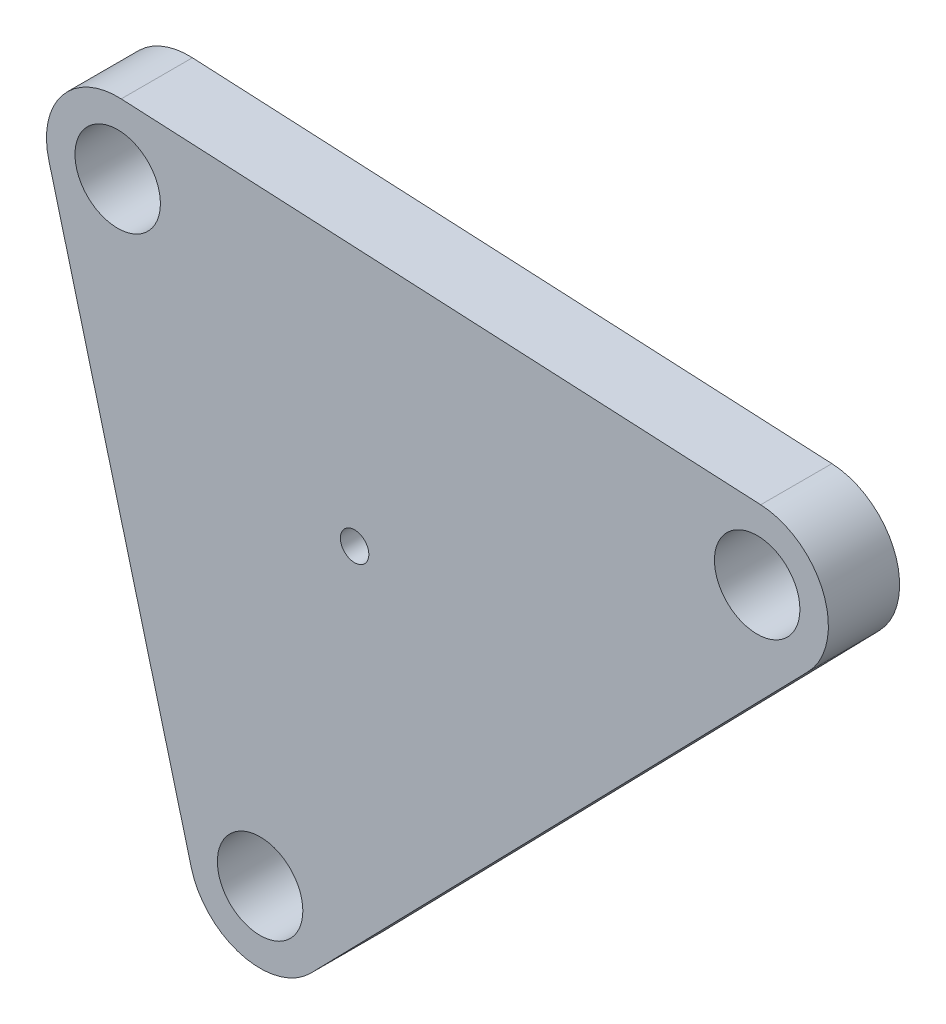
ISO-10303-21;
HEADER;
FILE_DESCRIPTION(('STEP AP214'),'2;1');
FILE_NAME('part.step','',(''),(''),'','','');
FILE_SCHEMA(('AUTOMOTIVE_DESIGN { 1 0 10303 214 1 1 1 1 }'));
ENDSEC;
DATA;
#1=APPLICATION_CONTEXT('core data for automotive mechanical design processes');
#2=APPLICATION_PROTOCOL_DEFINITION('international standard','automotive_design',2000,#1);
#3=PRODUCT_CONTEXT('',#1,'mechanical');
#4=PRODUCT('Part','Part','',(#3));
#5=PRODUCT_RELATED_PRODUCT_CATEGORY('part','',(#4));
#6=PRODUCT_DEFINITION_FORMATION('','',#4);
#7=PRODUCT_DEFINITION_CONTEXT('part definition',#1,'design');
#8=PRODUCT_DEFINITION('design','',#6,#7);
#9=PRODUCT_DEFINITION_SHAPE('','',#8);
#10=(LENGTH_UNIT() NAMED_UNIT(*) SI_UNIT(.MILLI.,.METRE.));
#11=(NAMED_UNIT(*) PLANE_ANGLE_UNIT() SI_UNIT($,.RADIAN.));
#12=(NAMED_UNIT(*) SI_UNIT($,.STERADIAN.) SOLID_ANGLE_UNIT());
#13=UNCERTAINTY_MEASURE_WITH_UNIT(LENGTH_MEASURE(1.E-05),#10,'distance_accuracy_value','');
#14=(GEOMETRIC_REPRESENTATION_CONTEXT(3) GLOBAL_UNCERTAINTY_ASSIGNED_CONTEXT((#13)) GLOBAL_UNIT_ASSIGNED_CONTEXT((#10,
#11,#12)) REPRESENTATION_CONTEXT('',''));
#15=CARTESIAN_POINT('',(0.,0.,0.));
#16=DIRECTION('',(0.,0.,1.));
#17=DIRECTION('',(1.,0.,0.));
#18=AXIS2_PLACEMENT_3D('',#15,#16,#17);
#19=CARTESIAN_POINT('',(7.58222232368378,-5.71752336448602,5.));
#20=DIRECTION('',(0.,0.,1.));
#21=DIRECTION('',(1.,0.,0.));
#22=AXIS2_PLACEMENT_3D('',#19,#20,#21);
#23=PLANE('',#22);
#24=CARTESIAN_POINT('',(17.5822223236839,-43.7175233644859,5.));
#25=DIRECTION('',(0.,0.,1.));
#26=DIRECTION('',(1.,0.,0.));
#27=AXIS2_PLACEMENT_3D('',#24,#25,#26);
#28=CIRCLE('',#27,3.);
#29=CARTESIAN_POINT('',(20.5822223236839,-43.7175233644859,5.));
#30=VERTEX_POINT('',#29);
#31=EDGE_CURVE('E187',#30,#30,#28,.T.);
#32=ORIENTED_EDGE('',*,*,#31,.F.);
#33=EDGE_LOOP('',(#32));
#34=FACE_BOUND('',#33,.T.);
#35=CARTESIAN_POINT('',(7.58222232368378,-5.71752336448602,5.));
#36=DIRECTION('',(0.,0.,1.));
#37=DIRECTION('',(1.,0.,0.));
#38=AXIS2_PLACEMENT_3D('',#35,#36,#37);
#39=CIRCLE('',#38,3.);
#40=CARTESIAN_POINT('',(10.5822223236838,-5.71752336448602,5.));
#41=VERTEX_POINT('',#40);
#42=EDGE_CURVE('E119',#41,#41,#39,.T.);
#43=ORIENTED_EDGE('',*,*,#42,.F.);
#44=EDGE_LOOP('',(#43));
#45=FACE_BOUND('',#44,.T.);
#46=CARTESIAN_POINT('',(7.58222232368378,-5.71752336448602,5.));
#47=DIRECTION('',(0.,0.,1.));
#48=DIRECTION('',(1.,0.,0.));
#49=AXIS2_PLACEMENT_3D('',#46,#47,#48);
#50=CIRCLE('',#49,5.);
#51=CARTESIAN_POINT('',(7.83008624468436,-0.723670795910712,5.));
#52=VERTEX_POINT('',#51);
#53=CARTESIAN_POINT('',(2.74684963737055,-6.98998986088426,5.));
#54=VERTEX_POINT('',#53);
#55=EDGE_CURVE('E126',#52,#54,#50,.T.);
#56=ORIENTED_EDGE('',*,*,#55,.T.);
#57=DIRECTION('',(0.254493299279647,-0.967074537262645,0.));
#58=VECTOR('',#57,1.);
#59=CARTESIAN_POINT('',(2.74684963737055,-6.98998986088426,5.));
#60=LINE('',#59,#58);
#61=CARTESIAN_POINT('',(12.7468496373707,-44.9899898608842,5.));
#62=VERTEX_POINT('',#61);
#63=EDGE_CURVE('E84',#54,#62,#60,.T.);
#64=ORIENTED_EDGE('',*,*,#63,.T.);
#65=CARTESIAN_POINT('',(17.5822223236839,-43.7175233644859,5.));
#66=DIRECTION('',(0.,0.,1.));
#67=DIRECTION('',(1.,0.,0.));
#68=AXIS2_PLACEMENT_3D('',#65,#66,#67);
#69=CIRCLE('',#68,5.);
#70=CARTESIAN_POINT('',(21.1610535568244,-47.2092230945169,5.));
#71=VERTEX_POINT('',#70);
#72=EDGE_CURVE('E97',#62,#71,#69,.T.);
#73=ORIENTED_EDGE('',*,*,#72,.T.);
#74=DIRECTION('',(0.698339946006185,0.7157662466281,0.));
#75=VECTOR('',#74,1.);
#76=CARTESIAN_POINT('',(21.1610535568244,-47.2092230945169,5.));
#77=LINE('',#76,#75);
#78=CARTESIAN_POINT('',(56.0615664285546,-11.4378065423657,5.));
#79=VERTEX_POINT('',#78);
#80=EDGE_CURVE('E91',#71,#79,#77,.T.);
#81=ORIENTED_EDGE('',*,*,#80,.T.);
#82=CARTESIAN_POINT('',(52.4827351954141,-7.94610681233479,5.));
#83=DIRECTION('',(0.,0.,1.));
#84=DIRECTION('',(1.,0.,0.));
#85=AXIS2_PLACEMENT_3D('',#82,#83,#84);
#86=CIRCLE('',#85,5.);
#87=CARTESIAN_POINT('',(52.7305991164147,-2.95225424375948,5.));
#88=VERTEX_POINT('',#87);
#89=EDGE_CURVE('E95',#79,#88,#86,.T.);
#90=ORIENTED_EDGE('',*,*,#89,.T.);
#91=DIRECTION('',(-0.998770513715062,0.0495727842001155,0.));
#92=VECTOR('',#91,1.);
#93=CARTESIAN_POINT('',(52.7305991164147,-2.95225424375948,5.));
#94=LINE('',#93,#92);
#95=EDGE_CURVE('E47',#88,#52,#94,.T.);
#96=ORIENTED_EDGE('',*,*,#95,.T.);
#97=EDGE_LOOP('',(#56,#64,#73,#81,#90,#96));
#98=FACE_BOUND('',#97,.T.);
#99=CARTESIAN_POINT('',(52.4827351954141,-7.94610681233479,5.));
#100=DIRECTION('',(0.,0.,1.));
#101=DIRECTION('',(1.,0.,0.));
#102=AXIS2_PLACEMENT_3D('',#99,#100,#101);
#103=CIRCLE('',#102,3.);
#104=CARTESIAN_POINT('',(55.4827351954141,-7.94610681233479,5.));
#105=VERTEX_POINT('',#104);
#106=EDGE_CURVE('E193',#105,#105,#103,.T.);
#107=ORIENTED_EDGE('',*,*,#106,.F.);
#108=EDGE_LOOP('',(#107));
#109=FACE_BOUND('',#108,.T.);
#110=CARTESIAN_POINT('',(24.2166737720373,-19.7339083537588,5.));
#111=DIRECTION('',(0.,0.,1.));
#112=DIRECTION('',(1.,0.,0.));
#113=AXIS2_PLACEMENT_3D('',#110,#111,#112);
#114=CIRCLE('',#113,1.);
#115=CARTESIAN_POINT('',(25.2166737720373,-19.7339083537588,5.));
#116=VERTEX_POINT('',#115);
#117=EDGE_CURVE('E178',#116,#116,#114,.T.);
#118=ORIENTED_EDGE('',*,*,#117,.F.);
#119=EDGE_LOOP('',(#118));
#120=FACE_BOUND('',#119,.T.);
#121=ADVANCED_FACE('F30',(#34,#45,#98,#109,#120),#23,.T.);
#122=CARTESIAN_POINT('',(7.58222232368378,-5.71752336448602,0.));
#123=DIRECTION('',(0.,0.,1.));
#124=DIRECTION('',(1.,0.,0.));
#125=AXIS2_PLACEMENT_3D('',#122,#123,#124);
#126=PLANE('',#125);
#127=CARTESIAN_POINT('',(17.5822223236839,-43.7175233644859,0.));
#128=DIRECTION('',(0.,0.,1.));
#129=DIRECTION('',(1.,0.,0.));
#130=AXIS2_PLACEMENT_3D('',#127,#128,#129);
#131=CIRCLE('',#130,3.);
#132=CARTESIAN_POINT('',(20.5822223236839,-43.7175233644859,0.));
#133=VERTEX_POINT('',#132);
#134=EDGE_CURVE('E184',#133,#133,#131,.T.);
#135=ORIENTED_EDGE('',*,*,#134,.T.);
#136=EDGE_LOOP('',(#135));
#137=FACE_BOUND('',#136,.T.);
#138=CARTESIAN_POINT('',(7.58222232368378,-5.71752336448602,0.));
#139=DIRECTION('',(0.,0.,1.));
#140=DIRECTION('',(1.,0.,0.));
#141=AXIS2_PLACEMENT_3D('',#138,#139,#140);
#142=CIRCLE('',#141,3.);
#143=CARTESIAN_POINT('',(10.5822223236838,-5.71752336448602,0.));
#144=VERTEX_POINT('',#143);
#145=EDGE_CURVE('E196',#144,#144,#142,.T.);
#146=ORIENTED_EDGE('',*,*,#145,.T.);
#147=EDGE_LOOP('',(#146));
#148=FACE_BOUND('',#147,.T.);
#149=CARTESIAN_POINT('',(7.58222232368378,-5.71752336448602,0.));
#150=DIRECTION('',(0.,0.,1.));
#151=DIRECTION('',(1.,0.,0.));
#152=AXIS2_PLACEMENT_3D('',#149,#150,#151);
#153=CIRCLE('',#152,5.);
#154=CARTESIAN_POINT('',(7.83008624468436,-0.723670795910712,0.));
#155=VERTEX_POINT('',#154);
#156=CARTESIAN_POINT('',(2.74684963737055,-6.98998986088426,0.));
#157=VERTEX_POINT('',#156);
#158=EDGE_CURVE('E115',#155,#157,#153,.T.);
#159=ORIENTED_EDGE('',*,*,#158,.F.);
#160=DIRECTION('',(-0.998770513715062,0.0495727842001155,0.));
#161=VECTOR('',#160,1.);
#162=CARTESIAN_POINT('',(52.7305991164147,-2.95225424375948,0.));
#163=LINE('',#162,#161);
#164=CARTESIAN_POINT('',(52.7305991164147,-2.95225424375948,0.));
#165=VERTEX_POINT('',#164);
#166=EDGE_CURVE('E76',#165,#155,#163,.T.);
#167=ORIENTED_EDGE('',*,*,#166,.F.);
#168=CARTESIAN_POINT('',(52.4827351954141,-7.94610681233479,0.));
#169=DIRECTION('',(0.,0.,1.));
#170=DIRECTION('',(1.,0.,0.));
#171=AXIS2_PLACEMENT_3D('',#168,#169,#170);
#172=CIRCLE('',#171,5.);
#173=CARTESIAN_POINT('',(56.0615664285546,-11.4378065423657,0.));
#174=VERTEX_POINT('',#173);
#175=EDGE_CURVE('E70',#174,#165,#172,.T.);
#176=ORIENTED_EDGE('',*,*,#175,.F.);
#177=DIRECTION('',(0.698339946006185,0.7157662466281,0.));
#178=VECTOR('',#177,1.);
#179=CARTESIAN_POINT('',(21.1610535568244,-47.2092230945169,0.));
#180=LINE('',#179,#178);
#181=CARTESIAN_POINT('',(21.1610535568244,-47.2092230945169,0.));
#182=VERTEX_POINT('',#181);
#183=EDGE_CURVE('E105',#182,#174,#180,.T.);
#184=ORIENTED_EDGE('',*,*,#183,.F.);
#185=CARTESIAN_POINT('',(17.5822223236839,-43.7175233644859,0.));
#186=DIRECTION('',(0.,0.,1.));
#187=DIRECTION('',(1.,0.,0.));
#188=AXIS2_PLACEMENT_3D('',#185,#186,#187);
#189=CIRCLE('',#188,5.);
#190=CARTESIAN_POINT('',(12.7468496373707,-44.9899898608842,0.));
#191=VERTEX_POINT('',#190);
#192=EDGE_CURVE('E121',#191,#182,#189,.T.);
#193=ORIENTED_EDGE('',*,*,#192,.F.);
#194=DIRECTION('',(0.254493299279647,-0.967074537262645,0.));
#195=VECTOR('',#194,1.);
#196=CARTESIAN_POINT('',(2.74684963737055,-6.98998986088426,0.));
#197=LINE('',#196,#195);
#198=EDGE_CURVE('E118',#157,#191,#197,.T.);
#199=ORIENTED_EDGE('',*,*,#198,.F.);
#200=EDGE_LOOP('',(#159,#167,#176,#184,#193,#199));
#201=FACE_BOUND('',#200,.T.);
#202=CARTESIAN_POINT('',(52.4827351954141,-7.94610681233479,0.));
#203=DIRECTION('',(0.,0.,1.));
#204=DIRECTION('',(1.,0.,0.));
#205=AXIS2_PLACEMENT_3D('',#202,#203,#204);
#206=CIRCLE('',#205,3.);
#207=CARTESIAN_POINT('',(55.4827351954141,-7.94610681233479,0.));
#208=VERTEX_POINT('',#207);
#209=EDGE_CURVE('E190',#208,#208,#206,.T.);
#210=ORIENTED_EDGE('',*,*,#209,.T.);
#211=EDGE_LOOP('',(#210));
#212=FACE_BOUND('',#211,.T.);
#213=CARTESIAN_POINT('',(24.2166737720373,-19.7339083537588,0.));
#214=DIRECTION('',(0.,0.,1.));
#215=DIRECTION('',(1.,0.,0.));
#216=AXIS2_PLACEMENT_3D('',#213,#214,#215);
#217=CIRCLE('',#216,1.);
#218=CARTESIAN_POINT('',(25.2166737720373,-19.7339083537588,0.));
#219=VERTEX_POINT('',#218);
#220=EDGE_CURVE('E181',#219,#219,#217,.T.);
#221=ORIENTED_EDGE('',*,*,#220,.T.);
#222=EDGE_LOOP('',(#221));
#223=FACE_BOUND('',#222,.T.);
#224=ADVANCED_FACE('F135',(#137,#148,#201,#212,#223),#126,.F.);
#225=CARTESIAN_POINT('',(7.58222232368378,-5.71752336448602,5.));
#226=DIRECTION('',(0.,0.,-1.));
#227=DIRECTION('',(-1.,0.,0.));
#228=AXIS2_PLACEMENT_3D('',#225,#226,#227);
#229=CYLINDRICAL_SURFACE('',#228,5.);
#230=ORIENTED_EDGE('',*,*,#158,.T.);
#231=DIRECTION('',(0.,0.,-1.));
#232=VECTOR('',#231,1.);
#233=CARTESIAN_POINT('',(2.74684963737055,-6.98998986088426,5.));
#234=LINE('',#233,#232);
#235=EDGE_CURVE('E11',#54,#157,#234,.T.);
#236=ORIENTED_EDGE('',*,*,#235,.F.);
#237=ORIENTED_EDGE('',*,*,#55,.F.);
#238=DIRECTION('',(0.,0.,-1.));
#239=VECTOR('',#238,1.);
#240=CARTESIAN_POINT('',(7.83008624468436,-0.723670795910712,5.));
#241=LINE('',#240,#239);
#242=EDGE_CURVE('E111',#52,#155,#241,.T.);
#243=ORIENTED_EDGE('',*,*,#242,.T.);
#244=EDGE_LOOP('',(#230,#236,#237,#243));
#245=FACE_BOUND('',#244,.T.);
#246=ADVANCED_FACE('F32',(#245),#229,.T.);
#247=CARTESIAN_POINT('',(2.74684963737055,-6.98998986088426,5.));
#248=DIRECTION('',(0.967074537262645,0.254493299279647,0.));
#249=DIRECTION('',(-0.254493299279648,0.967074537262646,0.));
#250=AXIS2_PLACEMENT_3D('',#247,#248,#249);
#251=PLANE('',#250);
#252=ORIENTED_EDGE('',*,*,#198,.T.);
#253=DIRECTION('',(0.,0.,-1.));
#254=VECTOR('',#253,1.);
#255=CARTESIAN_POINT('',(12.7468496373707,-44.9899898608842,5.));
#256=LINE('',#255,#254);
#257=EDGE_CURVE('E39',#62,#191,#256,.T.);
#258=ORIENTED_EDGE('',*,*,#257,.F.);
#259=ORIENTED_EDGE('',*,*,#63,.F.);
#260=ORIENTED_EDGE('',*,*,#235,.T.);
#261=EDGE_LOOP('',(#252,#258,#259,#260));
#262=FACE_BOUND('',#261,.T.);
#263=ADVANCED_FACE('F253',(#262),#251,.F.);
#264=CARTESIAN_POINT('',(17.5822223236839,-43.7175233644859,5.));
#265=DIRECTION('',(0.,0.,-1.));
#266=DIRECTION('',(-1.,0.,0.));
#267=AXIS2_PLACEMENT_3D('',#264,#265,#266);
#268=CYLINDRICAL_SURFACE('',#267,5.);
#269=ORIENTED_EDGE('',*,*,#192,.T.);
#270=DIRECTION('',(0.,0.,-1.));
#271=VECTOR('',#270,1.);
#272=CARTESIAN_POINT('',(21.1610535568244,-47.2092230945169,5.));
#273=LINE('',#272,#271);
#274=EDGE_CURVE('E106',#71,#182,#273,.T.);
#275=ORIENTED_EDGE('',*,*,#274,.F.);
#276=ORIENTED_EDGE('',*,*,#72,.F.);
#277=ORIENTED_EDGE('',*,*,#257,.T.);
#278=EDGE_LOOP('',(#269,#275,#276,#277));
#279=FACE_BOUND('',#278,.T.);
#280=ADVANCED_FACE('F132',(#279),#268,.T.);
#281=CARTESIAN_POINT('',(21.1610535568244,-47.2092230945169,5.));
#282=DIRECTION('',(-0.7157662466281,0.698339946006185,0.));
#283=DIRECTION('',(-0.698339946006186,-0.7157662466281,0.));
#284=AXIS2_PLACEMENT_3D('',#281,#282,#283);
#285=PLANE('',#284);
#286=ORIENTED_EDGE('',*,*,#183,.T.);
#287=DIRECTION('',(0.,0.,-1.));
#288=VECTOR('',#287,1.);
#289=CARTESIAN_POINT('',(56.0615664285546,-11.4378065423657,5.));
#290=LINE('',#289,#288);
#291=EDGE_CURVE('E102',#79,#174,#290,.T.);
#292=ORIENTED_EDGE('',*,*,#291,.F.);
#293=ORIENTED_EDGE('',*,*,#80,.F.);
#294=ORIENTED_EDGE('',*,*,#274,.T.);
#295=EDGE_LOOP('',(#286,#292,#293,#294));
#296=FACE_BOUND('',#295,.T.);
#297=ADVANCED_FACE('F103',(#296),#285,.F.);
#298=CARTESIAN_POINT('',(52.4827351954141,-7.94610681233479,5.));
#299=DIRECTION('',(0.,0.,-1.));
#300=DIRECTION('',(-1.,0.,0.));
#301=AXIS2_PLACEMENT_3D('',#298,#299,#300);
#302=CYLINDRICAL_SURFACE('',#301,5.);
#303=ORIENTED_EDGE('',*,*,#175,.T.);
#304=DIRECTION('',(0.,0.,-1.));
#305=VECTOR('',#304,1.);
#306=CARTESIAN_POINT('',(52.7305991164147,-2.95225424375948,5.));
#307=LINE('',#306,#305);
#308=EDGE_CURVE('E107',#88,#165,#307,.T.);
#309=ORIENTED_EDGE('',*,*,#308,.F.);
#310=ORIENTED_EDGE('',*,*,#89,.F.);
#311=ORIENTED_EDGE('',*,*,#291,.T.);
#312=EDGE_LOOP('',(#303,#309,#310,#311));
#313=FACE_BOUND('',#312,.T.);
#314=ADVANCED_FACE('F109',(#313),#302,.T.);
#315=CARTESIAN_POINT('',(52.7305991164147,-2.95225424375948,5.));
#316=DIRECTION('',(-0.0495727842001155,-0.998770513715062,0.));
#317=DIRECTION('',(0.998770513715062,-0.0495727842001155,0.));
#318=AXIS2_PLACEMENT_3D('',#315,#316,#317);
#319=PLANE('',#318);
#320=ORIENTED_EDGE('',*,*,#166,.T.);
#321=ORIENTED_EDGE('',*,*,#242,.F.);
#322=ORIENTED_EDGE('',*,*,#95,.F.);
#323=ORIENTED_EDGE('',*,*,#308,.T.);
#324=EDGE_LOOP('',(#320,#321,#322,#323));
#325=FACE_BOUND('',#324,.T.);
#326=ADVANCED_FACE('F140',(#325),#319,.F.);
#327=CARTESIAN_POINT('',(7.58222232368378,-5.71752336448602,5.));
#328=DIRECTION('',(0.,0.,-1.));
#329=DIRECTION('',(-1.,0.,0.));
#330=AXIS2_PLACEMENT_3D('',#327,#328,#329);
#331=CYLINDRICAL_SURFACE('',#330,3.);
#332=ORIENTED_EDGE('',*,*,#42,.T.);
#333=EDGE_LOOP('',(#332));
#334=FACE_BOUND('',#333,.T.);
#335=ORIENTED_EDGE('',*,*,#145,.F.);
#336=EDGE_LOOP('',(#335));
#337=FACE_BOUND('',#336,.T.);
#338=ADVANCED_FACE('F142',(#334,#337),#331,.F.);
#339=CARTESIAN_POINT('',(52.4827351954141,-7.94610681233479,5.));
#340=DIRECTION('',(0.,0.,-1.));
#341=DIRECTION('',(-1.,0.,0.));
#342=AXIS2_PLACEMENT_3D('',#339,#340,#341);
#343=CYLINDRICAL_SURFACE('',#342,3.);
#344=ORIENTED_EDGE('',*,*,#106,.T.);
#345=EDGE_LOOP('',(#344));
#346=FACE_BOUND('',#345,.T.);
#347=ORIENTED_EDGE('',*,*,#209,.F.);
#348=EDGE_LOOP('',(#347));
#349=FACE_BOUND('',#348,.T.);
#350=ADVANCED_FACE('F148',(#346,#349),#343,.F.);
#351=CARTESIAN_POINT('',(17.5822223236839,-43.7175233644859,5.));
#352=DIRECTION('',(0.,0.,-1.));
#353=DIRECTION('',(-1.,0.,0.));
#354=AXIS2_PLACEMENT_3D('',#351,#352,#353);
#355=CYLINDRICAL_SURFACE('',#354,3.);
#356=ORIENTED_EDGE('',*,*,#31,.T.);
#357=EDGE_LOOP('',(#356));
#358=FACE_BOUND('',#357,.T.);
#359=ORIENTED_EDGE('',*,*,#134,.F.);
#360=EDGE_LOOP('',(#359));
#361=FACE_BOUND('',#360,.T.);
#362=ADVANCED_FACE('F165',(#358,#361),#355,.F.);
#363=CARTESIAN_POINT('',(24.2166737720373,-19.7339083537588,5.));
#364=DIRECTION('',(0.,0.,-1.));
#365=DIRECTION('',(-1.,0.,0.));
#366=AXIS2_PLACEMENT_3D('',#363,#364,#365);
#367=CYLINDRICAL_SURFACE('',#366,1.);
#368=ORIENTED_EDGE('',*,*,#117,.T.);
#369=EDGE_LOOP('',(#368));
#370=FACE_BOUND('',#369,.T.);
#371=ORIENTED_EDGE('',*,*,#220,.F.);
#372=EDGE_LOOP('',(#371));
#373=FACE_BOUND('',#372,.T.);
#374=ADVANCED_FACE('F169',(#370,#373),#367,.F.);
#375=CLOSED_SHELL('',(#121,#224,#246,#263,#280,#297,#314,#326,#338,#350,#362,#374));
#376=MANIFOLD_SOLID_BREP('B2',#375);
#377=ADVANCED_BREP_SHAPE_REPRESENTATION('',(#18,#376),#14);
#378=SHAPE_DEFINITION_REPRESENTATION(#9,#377);
ENDSEC;
END-ISO-10303-21;
